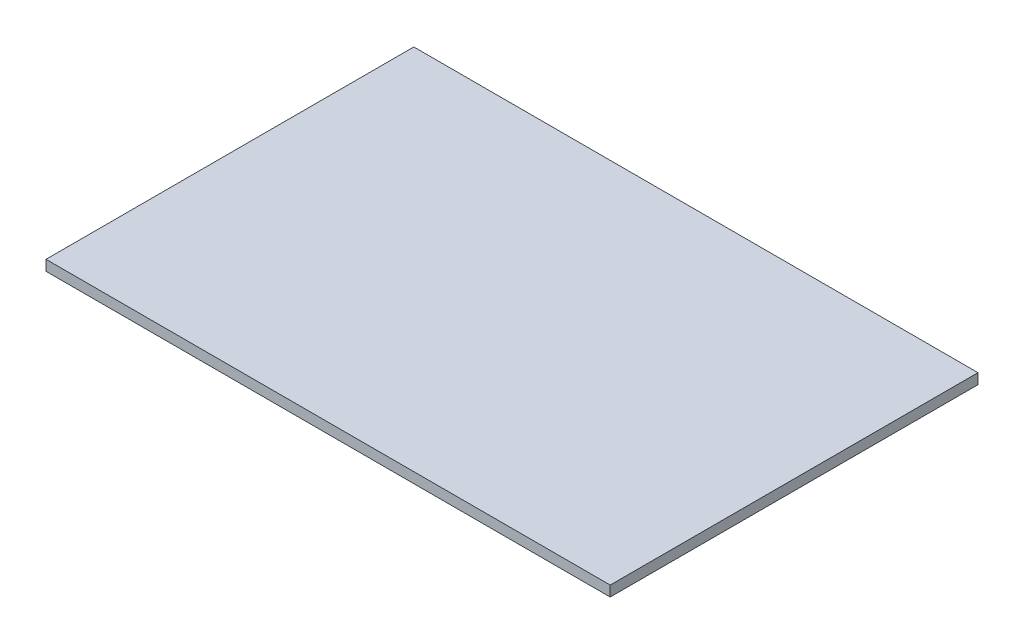
ISO-10303-21;
HEADER;
FILE_DESCRIPTION(('STEP AP214'),'2;1');
FILE_NAME('part.step','',(''),(''),'','','');
FILE_SCHEMA(('AUTOMOTIVE_DESIGN { 1 0 10303 214 1 1 1 1 }'));
ENDSEC;
DATA;
#1=APPLICATION_CONTEXT('core data for automotive mechanical design processes');
#2=APPLICATION_PROTOCOL_DEFINITION('international standard','automotive_design',2000,#1);
#3=PRODUCT_CONTEXT('',#1,'mechanical');
#4=PRODUCT('Part','Part','',(#3));
#5=PRODUCT_RELATED_PRODUCT_CATEGORY('part','',(#4));
#6=PRODUCT_DEFINITION_FORMATION('','',#4);
#7=PRODUCT_DEFINITION_CONTEXT('part definition',#1,'design');
#8=PRODUCT_DEFINITION('design','',#6,#7);
#9=PRODUCT_DEFINITION_SHAPE('','',#8);
#10=(LENGTH_UNIT() NAMED_UNIT(*) SI_UNIT(.MILLI.,.METRE.));
#11=(NAMED_UNIT(*) PLANE_ANGLE_UNIT() SI_UNIT($,.RADIAN.));
#12=(NAMED_UNIT(*) SI_UNIT($,.STERADIAN.) SOLID_ANGLE_UNIT());
#13=UNCERTAINTY_MEASURE_WITH_UNIT(LENGTH_MEASURE(1.E-05),#10,'distance_accuracy_value','');
#14=(GEOMETRIC_REPRESENTATION_CONTEXT(3) GLOBAL_UNCERTAINTY_ASSIGNED_CONTEXT((#13)) GLOBAL_UNIT_ASSIGNED_CONTEXT((#10,
#11,#12)) REPRESENTATION_CONTEXT('',''));
#15=CARTESIAN_POINT('',(0.,0.,0.));
#16=DIRECTION('',(0.,0.,1.));
#17=DIRECTION('',(1.,0.,0.));
#18=AXIS2_PLACEMENT_3D('',#15,#16,#17);
#19=CARTESIAN_POINT('',(40.65,1.5,26.5));
#20=DIRECTION('',(-1.,0.,0.));
#21=DIRECTION('',(0.,0.,1.));
#22=AXIS2_PLACEMENT_3D('',#19,#20,#21);
#23=PLANE('',#22);
#24=DIRECTION('',(0.,0.,-1.));
#25=VECTOR('',#24,1.);
#26=CARTESIAN_POINT('',(40.65,0.,26.5));
#27=LINE('',#26,#25);
#28=CARTESIAN_POINT('',(40.65,0.,26.5));
#29=VERTEX_POINT('',#28);
#30=CARTESIAN_POINT('',(40.65,0.,-26.5));
#31=VERTEX_POINT('',#30);
#32=EDGE_CURVE('E99',#29,#31,#27,.T.);
#33=ORIENTED_EDGE('',*,*,#32,.T.);
#34=DIRECTION('',(0.,-1.,0.));
#35=VECTOR('',#34,1.);
#36=CARTESIAN_POINT('',(40.65,1.5,-26.5));
#37=LINE('',#36,#35);
#38=CARTESIAN_POINT('',(40.65,1.5,-26.5));
#39=VERTEX_POINT('',#38);
#40=EDGE_CURVE('E11',#39,#31,#37,.T.);
#41=ORIENTED_EDGE('',*,*,#40,.F.);
#42=DIRECTION('',(0.,0.,-1.));
#43=VECTOR('',#42,1.);
#44=CARTESIAN_POINT('',(40.65,1.5,26.5));
#45=LINE('',#44,#43);
#46=CARTESIAN_POINT('',(40.65,1.5,26.5));
#47=VERTEX_POINT('',#46);
#48=EDGE_CURVE('E87',#47,#39,#45,.T.);
#49=ORIENTED_EDGE('',*,*,#48,.F.);
#50=DIRECTION('',(0.,-1.,0.));
#51=VECTOR('',#50,1.);
#52=CARTESIAN_POINT('',(40.65,1.5,26.5));
#53=LINE('',#52,#51);
#54=EDGE_CURVE('E95',#47,#29,#53,.T.);
#55=ORIENTED_EDGE('',*,*,#54,.T.);
#56=EDGE_LOOP('',(#33,#41,#49,#55));
#57=FACE_BOUND('',#56,.T.);
#58=ADVANCED_FACE('F36',(#57),#23,.F.);
#59=CARTESIAN_POINT('',(-40.65,1.5,-26.5));
#60=DIRECTION('',(0.,0.,1.));
#61=DIRECTION('',(1.,0.,0.));
#62=AXIS2_PLACEMENT_3D('',#59,#60,#61);
#63=PLANE('',#62);
#64=DIRECTION('',(-1.,0.,0.));
#65=VECTOR('',#64,1.);
#66=CARTESIAN_POINT('',(-40.65,0.,-26.5));
#67=LINE('',#66,#65);
#68=CARTESIAN_POINT('',(-40.65,0.,-26.5));
#69=VERTEX_POINT('',#68);
#70=EDGE_CURVE('E91',#31,#69,#67,.T.);
#71=ORIENTED_EDGE('',*,*,#70,.T.);
#72=DIRECTION('',(0.,-1.,0.));
#73=VECTOR('',#72,1.);
#74=CARTESIAN_POINT('',(-40.65,1.5,-26.5));
#75=LINE('',#74,#73);
#76=CARTESIAN_POINT('',(-40.65,1.5,-26.5));
#77=VERTEX_POINT('',#76);
#78=EDGE_CURVE('E44',#77,#69,#75,.T.);
#79=ORIENTED_EDGE('',*,*,#78,.F.);
#80=DIRECTION('',(-1.,0.,0.));
#81=VECTOR('',#80,1.);
#82=CARTESIAN_POINT('',(-40.65,1.5,-26.5));
#83=LINE('',#82,#81);
#84=EDGE_CURVE('E82',#39,#77,#83,.T.);
#85=ORIENTED_EDGE('',*,*,#84,.F.);
#86=ORIENTED_EDGE('',*,*,#40,.T.);
#87=EDGE_LOOP('',(#71,#79,#85,#86));
#88=FACE_BOUND('',#87,.T.);
#89=ADVANCED_FACE('F90',(#88),#63,.F.);
#90=CARTESIAN_POINT('',(-40.65,1.5,26.5));
#91=DIRECTION('',(1.,0.,0.));
#92=DIRECTION('',(0.,0.,-1.));
#93=AXIS2_PLACEMENT_3D('',#90,#91,#92);
#94=PLANE('',#93);
#95=DIRECTION('',(0.,0.,1.));
#96=VECTOR('',#95,1.);
#97=CARTESIAN_POINT('',(-40.65,0.,26.5));
#98=LINE('',#97,#96);
#99=CARTESIAN_POINT('',(-40.65,0.,26.5));
#100=VERTEX_POINT('',#99);
#101=EDGE_CURVE('E69',#69,#100,#98,.T.);
#102=ORIENTED_EDGE('',*,*,#101,.T.);
#103=DIRECTION('',(0.,-1.,0.));
#104=VECTOR('',#103,1.);
#105=CARTESIAN_POINT('',(-40.65,1.5,26.5));
#106=LINE('',#105,#104);
#107=CARTESIAN_POINT('',(-40.65,1.5,26.5));
#108=VERTEX_POINT('',#107);
#109=EDGE_CURVE('E92',#108,#100,#106,.T.);
#110=ORIENTED_EDGE('',*,*,#109,.F.);
#111=DIRECTION('',(0.,0.,1.));
#112=VECTOR('',#111,1.);
#113=CARTESIAN_POINT('',(-40.65,1.5,26.5));
#114=LINE('',#113,#112);
#115=EDGE_CURVE('E85',#77,#108,#114,.T.);
#116=ORIENTED_EDGE('',*,*,#115,.F.);
#117=ORIENTED_EDGE('',*,*,#78,.T.);
#118=EDGE_LOOP('',(#102,#110,#116,#117));
#119=FACE_BOUND('',#118,.T.);
#120=ADVANCED_FACE('F93',(#119),#94,.F.);
#121=CARTESIAN_POINT('',(-40.65,1.5,26.5));
#122=DIRECTION('',(0.,0.,-1.));
#123=DIRECTION('',(-1.,0.,0.));
#124=AXIS2_PLACEMENT_3D('',#121,#122,#123);
#125=PLANE('',#124);
#126=DIRECTION('',(1.,0.,0.));
#127=VECTOR('',#126,1.);
#128=CARTESIAN_POINT('',(-40.65,0.,26.5));
#129=LINE('',#128,#127);
#130=EDGE_CURVE('E75',#100,#29,#129,.T.);
#131=ORIENTED_EDGE('',*,*,#130,.T.);
#132=ORIENTED_EDGE('',*,*,#54,.F.);
#133=DIRECTION('',(1.,0.,0.));
#134=VECTOR('',#133,1.);
#135=CARTESIAN_POINT('',(-40.65,1.5,26.5));
#136=LINE('',#135,#134);
#137=EDGE_CURVE('E52',#108,#47,#136,.T.);
#138=ORIENTED_EDGE('',*,*,#137,.F.);
#139=ORIENTED_EDGE('',*,*,#109,.T.);
#140=EDGE_LOOP('',(#131,#132,#138,#139));
#141=FACE_BOUND('',#140,.T.);
#142=ADVANCED_FACE('F106',(#141),#125,.F.);
#143=CARTESIAN_POINT('',(0.,1.5,0.));
#144=DIRECTION('',(0.,-1.,0.));
#145=DIRECTION('',(0.,0.,-1.));
#146=AXIS2_PLACEMENT_3D('',#143,#144,#145);
#147=PLANE('',#146);
#148=ORIENTED_EDGE('',*,*,#48,.T.);
#149=ORIENTED_EDGE('',*,*,#84,.T.);
#150=ORIENTED_EDGE('',*,*,#115,.T.);
#151=ORIENTED_EDGE('',*,*,#137,.T.);
#152=EDGE_LOOP('',(#148,#149,#150,#151));
#153=FACE_BOUND('',#152,.T.);
#154=ADVANCED_FACE('F83',(#153),#147,.F.);
#155=CARTESIAN_POINT('',(0.,0.,0.));
#156=DIRECTION('',(0.,-1.,0.));
#157=DIRECTION('',(0.,0.,-1.));
#158=AXIS2_PLACEMENT_3D('',#155,#156,#157);
#159=PLANE('',#158);
#160=ORIENTED_EDGE('',*,*,#32,.F.);
#161=ORIENTED_EDGE('',*,*,#130,.F.);
#162=ORIENTED_EDGE('',*,*,#101,.F.);
#163=ORIENTED_EDGE('',*,*,#70,.F.);
#164=EDGE_LOOP('',(#160,#161,#162,#163));
#165=FACE_BOUND('',#164,.T.);
#166=ADVANCED_FACE('F109',(#165),#159,.T.);
#167=CLOSED_SHELL('',(#58,#89,#120,#142,#154,#166));
#168=MANIFOLD_SOLID_BREP('B2',#167);
#169=ADVANCED_BREP_SHAPE_REPRESENTATION('',(#18,#168),#14);
#170=SHAPE_DEFINITION_REPRESENTATION(#9,#169);
ENDSEC;
END-ISO-10303-21;
